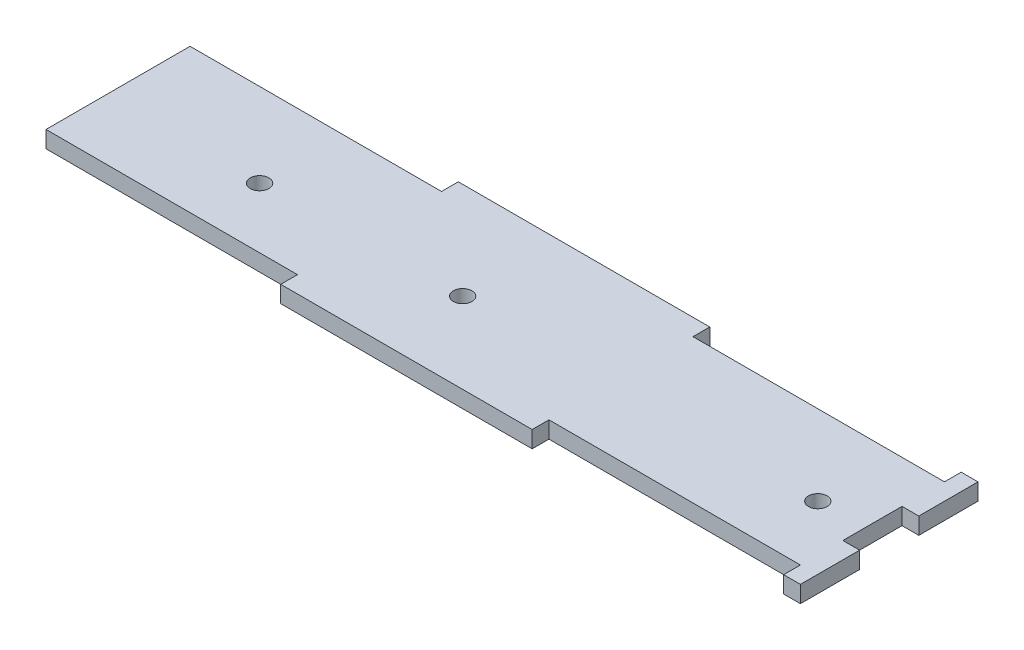
ISO-10303-21;
HEADER;
FILE_DESCRIPTION(('STEP AP214'),'2;1');
FILE_NAME('part.step','',(''),(''),'','','');
FILE_SCHEMA(('AUTOMOTIVE_DESIGN { 1 0 10303 214 1 1 1 1 }'));
ENDSEC;
DATA;
#1=APPLICATION_CONTEXT('core data for automotive mechanical design processes');
#2=APPLICATION_PROTOCOL_DEFINITION('international standard','automotive_design',2000,#1);
#3=PRODUCT_CONTEXT('',#1,'mechanical');
#4=PRODUCT('Part','Part','',(#3));
#5=PRODUCT_RELATED_PRODUCT_CATEGORY('part','',(#4));
#6=PRODUCT_DEFINITION_FORMATION('','',#4);
#7=PRODUCT_DEFINITION_CONTEXT('part definition',#1,'design');
#8=PRODUCT_DEFINITION('design','',#6,#7);
#9=PRODUCT_DEFINITION_SHAPE('','',#8);
#10=(LENGTH_UNIT() NAMED_UNIT(*) SI_UNIT(.MILLI.,.METRE.));
#11=(NAMED_UNIT(*) PLANE_ANGLE_UNIT() SI_UNIT($,.RADIAN.));
#12=(NAMED_UNIT(*) SI_UNIT($,.STERADIAN.) SOLID_ANGLE_UNIT());
#13=UNCERTAINTY_MEASURE_WITH_UNIT(LENGTH_MEASURE(1.E-05),#10,'distance_accuracy_value','');
#14=(GEOMETRIC_REPRESENTATION_CONTEXT(3) GLOBAL_UNCERTAINTY_ASSIGNED_CONTEXT((#13)) GLOBAL_UNIT_ASSIGNED_CONTEXT((#10,
#11,#12)) REPRESENTATION_CONTEXT('',''));
#15=CARTESIAN_POINT('',(0.,0.,0.));
#16=DIRECTION('',(0.,0.,1.));
#17=DIRECTION('',(1.,0.,0.));
#18=AXIS2_PLACEMENT_3D('',#15,#16,#17);
#19=CARTESIAN_POINT('',(-117.5,2.7,1.71046160917993E-13));
#20=DIRECTION('',(1.,0.,0.));
#21=DIRECTION('',(0.,0.,-1.));
#22=AXIS2_PLACEMENT_3D('',#19,#20,#21);
#23=PLANE('',#22);
#24=DIRECTION('',(0.,0.,1.));
#25=VECTOR('',#24,1.);
#26=CARTESIAN_POINT('',(-117.5,0.,1.71046160917993E-13));
#27=LINE('',#26,#25);
#28=CARTESIAN_POINT('',(-117.5,0.,-19.2));
#29=VERTEX_POINT('',#28);
#30=CARTESIAN_POINT('',(-117.5,0.,4.));
#31=VERTEX_POINT('',#30);
#32=EDGE_CURVE('E215',#29,#31,#27,.T.);
#33=ORIENTED_EDGE('',*,*,#32,.T.);
#34=DIRECTION('',(0.,-1.,0.));
#35=VECTOR('',#34,1.);
#36=CARTESIAN_POINT('',(-117.5,2.7,4.));
#37=LINE('',#36,#35);
#38=CARTESIAN_POINT('',(-117.5,2.7,4.));
#39=VERTEX_POINT('',#38);
#40=EDGE_CURVE('E11',#39,#31,#37,.T.);
#41=ORIENTED_EDGE('',*,*,#40,.F.);
#42=DIRECTION('',(0.,0.,1.));
#43=VECTOR('',#42,1.);
#44=CARTESIAN_POINT('',(-117.5,2.7,1.71046160917993E-13));
#45=LINE('',#44,#43);
#46=CARTESIAN_POINT('',(-117.5,2.7,-19.2));
#47=VERTEX_POINT('',#46);
#48=EDGE_CURVE('E627',#47,#39,#45,.T.);
#49=ORIENTED_EDGE('',*,*,#48,.F.);
#50=DIRECTION('',(0.,-1.,0.));
#51=VECTOR('',#50,1.);
#52=CARTESIAN_POINT('',(-117.5,2.7,-19.2));
#53=LINE('',#52,#51);
#54=EDGE_CURVE('E52',#47,#29,#53,.T.);
#55=ORIENTED_EDGE('',*,*,#54,.T.);
#56=EDGE_LOOP('',(#33,#41,#49,#55));
#57=FACE_BOUND('',#56,.T.);
#58=ADVANCED_FACE('F35',(#57),#23,.F.);
#59=CARTESIAN_POINT('',(0.,2.7,4.));
#60=DIRECTION('',(0.,0.,-1.));
#61=DIRECTION('',(-1.,0.,0.));
#62=AXIS2_PLACEMENT_3D('',#59,#60,#61);
#63=PLANE('',#62);
#64=DIRECTION('',(1.,0.,0.));
#65=VECTOR('',#64,1.);
#66=CARTESIAN_POINT('',(0.,0.,4.));
#67=LINE('',#66,#65);
#68=CARTESIAN_POINT('',(-77.,0.,4.));
#69=VERTEX_POINT('',#68);
#70=EDGE_CURVE('E217',#31,#69,#67,.T.);
#71=ORIENTED_EDGE('',*,*,#70,.T.);
#72=DIRECTION('',(0.,-1.,0.));
#73=VECTOR('',#72,1.);
#74=CARTESIAN_POINT('',(-77.,2.7,4.));
#75=LINE('',#74,#73);
#76=CARTESIAN_POINT('',(-77.,2.7,4.));
#77=VERTEX_POINT('',#76);
#78=EDGE_CURVE('E44',#77,#69,#75,.T.);
#79=ORIENTED_EDGE('',*,*,#78,.F.);
#80=DIRECTION('',(1.,0.,0.));
#81=VECTOR('',#80,1.);
#82=CARTESIAN_POINT('',(0.,2.7,4.));
#83=LINE('',#82,#81);
#84=EDGE_CURVE('E126',#39,#77,#83,.T.);
#85=ORIENTED_EDGE('',*,*,#84,.F.);
#86=ORIENTED_EDGE('',*,*,#40,.T.);
#87=EDGE_LOOP('',(#71,#79,#85,#86));
#88=FACE_BOUND('',#87,.T.);
#89=ADVANCED_FACE('F372',(#88),#63,.F.);
#90=CARTESIAN_POINT('',(-77.,2.7,0.));
#91=DIRECTION('',(1.,0.,0.));
#92=DIRECTION('',(0.,0.,-1.));
#93=AXIS2_PLACEMENT_3D('',#90,#91,#92);
#94=PLANE('',#93);
#95=DIRECTION('',(0.,0.,1.));
#96=VECTOR('',#95,1.);
#97=CARTESIAN_POINT('',(-77.,0.,0.));
#98=LINE('',#97,#96);
#99=CARTESIAN_POINT('',(-77.,0.,6.70000000000001));
#100=VERTEX_POINT('',#99);
#101=EDGE_CURVE('E219',#69,#100,#98,.T.);
#102=ORIENTED_EDGE('',*,*,#101,.T.);
#103=DIRECTION('',(0.,-1.,0.));
#104=VECTOR('',#103,1.);
#105=CARTESIAN_POINT('',(-77.,2.7,6.70000000000001));
#106=LINE('',#105,#104);
#107=CARTESIAN_POINT('',(-77.,2.7,6.70000000000001));
#108=VERTEX_POINT('',#107);
#109=EDGE_CURVE('E299',#108,#100,#106,.T.);
#110=ORIENTED_EDGE('',*,*,#109,.F.);
#111=DIRECTION('',(0.,0.,1.));
#112=VECTOR('',#111,1.);
#113=CARTESIAN_POINT('',(-77.,2.7,0.));
#114=LINE('',#113,#112);
#115=EDGE_CURVE('E306',#77,#108,#114,.T.);
#116=ORIENTED_EDGE('',*,*,#115,.F.);
#117=ORIENTED_EDGE('',*,*,#78,.T.);
#118=EDGE_LOOP('',(#102,#110,#116,#117));
#119=FACE_BOUND('',#118,.T.);
#120=ADVANCED_FACE('F304',(#119),#94,.F.);
#121=CARTESIAN_POINT('',(0.,2.7,6.7));
#122=DIRECTION('',(0.,0.,1.));
#123=DIRECTION('',(1.,0.,0.));
#124=AXIS2_PLACEMENT_3D('',#121,#122,#123);
#125=PLANE('',#124);
#126=DIRECTION('',(-1.,0.,0.));
#127=VECTOR('',#126,1.);
#128=CARTESIAN_POINT('',(0.,0.,6.7));
#129=LINE('',#128,#127);
#130=CARTESIAN_POINT('',(-36.5,0.,6.7));
#131=VERTEX_POINT('',#130);
#132=EDGE_CURVE('E222',#131,#100,#129,.T.);
#133=ORIENTED_EDGE('',*,*,#132,.F.);
#134=DIRECTION('',(0.,-1.,0.));
#135=VECTOR('',#134,1.);
#136=CARTESIAN_POINT('',(-36.5,2.7,6.7));
#137=LINE('',#136,#135);
#138=CARTESIAN_POINT('',(-36.5,2.7,6.7));
#139=VERTEX_POINT('',#138);
#140=EDGE_CURVE('E297',#139,#131,#137,.T.);
#141=ORIENTED_EDGE('',*,*,#140,.F.);
#142=DIRECTION('',(-1.,0.,0.));
#143=VECTOR('',#142,1.);
#144=CARTESIAN_POINT('',(0.,2.7,6.7));
#145=LINE('',#144,#143);
#146=EDGE_CURVE('E316',#139,#108,#145,.T.);
#147=ORIENTED_EDGE('',*,*,#146,.T.);
#148=ORIENTED_EDGE('',*,*,#109,.T.);
#149=EDGE_LOOP('',(#133,#141,#147,#148));
#150=FACE_BOUND('',#149,.T.);
#151=ADVANCED_FACE('F313',(#150),#125,.T.);
#152=CARTESIAN_POINT('',(-36.5,2.7,0.));
#153=DIRECTION('',(1.,0.,0.));
#154=DIRECTION('',(0.,0.,-1.));
#155=AXIS2_PLACEMENT_3D('',#152,#153,#154);
#156=PLANE('',#155);
#157=DIRECTION('',(0.,0.,1.));
#158=VECTOR('',#157,1.);
#159=CARTESIAN_POINT('',(-36.5,0.,0.));
#160=LINE('',#159,#158);
#161=CARTESIAN_POINT('',(-36.5,0.,4.));
#162=VERTEX_POINT('',#161);
#163=EDGE_CURVE('E225',#162,#131,#160,.T.);
#164=ORIENTED_EDGE('',*,*,#163,.F.);
#165=DIRECTION('',(0.,-1.,0.));
#166=VECTOR('',#165,1.);
#167=CARTESIAN_POINT('',(-36.5,2.7,4.));
#168=LINE('',#167,#166);
#169=CARTESIAN_POINT('',(-36.5,2.7,4.));
#170=VERTEX_POINT('',#169);
#171=EDGE_CURVE('E295',#170,#162,#168,.T.);
#172=ORIENTED_EDGE('',*,*,#171,.F.);
#173=DIRECTION('',(0.,0.,1.));
#174=VECTOR('',#173,1.);
#175=CARTESIAN_POINT('',(-36.5,2.7,0.));
#176=LINE('',#175,#174);
#177=EDGE_CURVE('E319',#170,#139,#176,.T.);
#178=ORIENTED_EDGE('',*,*,#177,.T.);
#179=ORIENTED_EDGE('',*,*,#140,.T.);
#180=EDGE_LOOP('',(#164,#172,#178,#179));
#181=FACE_BOUND('',#180,.T.);
#182=ADVANCED_FACE('F551',(#181),#156,.T.);
#183=CARTESIAN_POINT('',(0.,2.7,4.));
#184=DIRECTION('',(0.,0.,-1.));
#185=DIRECTION('',(-1.,0.,0.));
#186=AXIS2_PLACEMENT_3D('',#183,#184,#185);
#187=PLANE('',#186);
#188=DIRECTION('',(1.,0.,0.));
#189=VECTOR('',#188,1.);
#190=CARTESIAN_POINT('',(0.,0.,4.));
#191=LINE('',#190,#189);
#192=CARTESIAN_POINT('',(4.,0.,4.));
#193=VERTEX_POINT('',#192);
#194=EDGE_CURVE('E228',#162,#193,#191,.T.);
#195=ORIENTED_EDGE('',*,*,#194,.T.);
#196=DIRECTION('',(0.,-1.,0.));
#197=VECTOR('',#196,1.);
#198=CARTESIAN_POINT('',(4.,2.7,4.));
#199=LINE('',#198,#197);
#200=CARTESIAN_POINT('',(4.,2.7,4.));
#201=VERTEX_POINT('',#200);
#202=EDGE_CURVE('E292',#201,#193,#199,.T.);
#203=ORIENTED_EDGE('',*,*,#202,.F.);
#204=DIRECTION('',(1.,0.,0.));
#205=VECTOR('',#204,1.);
#206=CARTESIAN_POINT('',(0.,2.7,4.));
#207=LINE('',#206,#205);
#208=EDGE_CURVE('E321',#170,#201,#207,.T.);
#209=ORIENTED_EDGE('',*,*,#208,.F.);
#210=ORIENTED_EDGE('',*,*,#171,.T.);
#211=EDGE_LOOP('',(#195,#203,#209,#210));
#212=FACE_BOUND('',#211,.T.);
#213=ADVANCED_FACE('F542',(#212),#187,.F.);
#214=CARTESIAN_POINT('',(4.,2.7,0.));
#215=DIRECTION('',(1.,0.,0.));
#216=DIRECTION('',(0.,0.,-1.));
#217=AXIS2_PLACEMENT_3D('',#214,#215,#216);
#218=PLANE('',#217);
#219=DIRECTION('',(0.,0.,1.));
#220=VECTOR('',#219,1.);
#221=CARTESIAN_POINT('',(4.,0.,0.));
#222=LINE('',#221,#220);
#223=CARTESIAN_POINT('',(4.,0.,6.7));
#224=VERTEX_POINT('',#223);
#225=EDGE_CURVE('E230',#193,#224,#222,.T.);
#226=ORIENTED_EDGE('',*,*,#225,.T.);
#227=DIRECTION('',(0.,-1.,0.));
#228=VECTOR('',#227,1.);
#229=CARTESIAN_POINT('',(4.,2.7,6.7));
#230=LINE('',#229,#228);
#231=CARTESIAN_POINT('',(4.,2.7,6.7));
#232=VERTEX_POINT('',#231);
#233=EDGE_CURVE('E290',#232,#224,#230,.T.);
#234=ORIENTED_EDGE('',*,*,#233,.F.);
#235=DIRECTION('',(0.,0.,1.));
#236=VECTOR('',#235,1.);
#237=CARTESIAN_POINT('',(4.,2.7,0.));
#238=LINE('',#237,#236);
#239=EDGE_CURVE('E327',#201,#232,#238,.T.);
#240=ORIENTED_EDGE('',*,*,#239,.F.);
#241=ORIENTED_EDGE('',*,*,#202,.T.);
#242=EDGE_LOOP('',(#226,#234,#240,#241));
#243=FACE_BOUND('',#242,.T.);
#244=ADVANCED_FACE('F533',(#243),#218,.F.);
#245=CARTESIAN_POINT('',(0.,2.7,6.7));
#246=DIRECTION('',(0.,0.,1.));
#247=DIRECTION('',(1.,0.,0.));
#248=AXIS2_PLACEMENT_3D('',#245,#246,#247);
#249=PLANE('',#248);
#250=DIRECTION('',(-1.,0.,0.));
#251=VECTOR('',#250,1.);
#252=CARTESIAN_POINT('',(0.,0.,6.7));
#253=LINE('',#252,#251);
#254=CARTESIAN_POINT('',(6.7,0.,6.7));
#255=VERTEX_POINT('',#254);
#256=EDGE_CURVE('E233',#255,#224,#253,.T.);
#257=ORIENTED_EDGE('',*,*,#256,.F.);
#258=DIRECTION('',(0.,-1.,0.));
#259=VECTOR('',#258,1.);
#260=CARTESIAN_POINT('',(6.7,2.7,6.7));
#261=LINE('',#260,#259);
#262=CARTESIAN_POINT('',(6.7,2.7,6.7));
#263=VERTEX_POINT('',#262);
#264=EDGE_CURVE('E288',#263,#255,#261,.T.);
#265=ORIENTED_EDGE('',*,*,#264,.F.);
#266=DIRECTION('',(-1.,0.,0.));
#267=VECTOR('',#266,1.);
#268=CARTESIAN_POINT('',(0.,2.7,6.7));
#269=LINE('',#268,#267);
#270=EDGE_CURVE('E329',#263,#232,#269,.T.);
#271=ORIENTED_EDGE('',*,*,#270,.T.);
#272=ORIENTED_EDGE('',*,*,#233,.T.);
#273=EDGE_LOOP('',(#257,#265,#271,#272));
#274=FACE_BOUND('',#273,.T.);
#275=ADVANCED_FACE('F524',(#274),#249,.T.);
#276=CARTESIAN_POINT('',(6.7,2.7,0.));
#277=DIRECTION('',(-1.,0.,0.));
#278=DIRECTION('',(0.,0.,1.));
#279=AXIS2_PLACEMENT_3D('',#276,#277,#278);
#280=PLANE('',#279);
#281=DIRECTION('',(0.,0.,-1.));
#282=VECTOR('',#281,1.);
#283=CARTESIAN_POINT('',(6.7,0.,0.));
#284=LINE('',#283,#282);
#285=CARTESIAN_POINT('',(6.7,0.,-2.83333333333334));
#286=VERTEX_POINT('',#285);
#287=EDGE_CURVE('E236',#255,#286,#284,.T.);
#288=ORIENTED_EDGE('',*,*,#287,.T.);
#289=DIRECTION('',(0.,-1.,0.));
#290=VECTOR('',#289,1.);
#291=CARTESIAN_POINT('',(6.7,2.7,-2.83333333333334));
#292=LINE('',#291,#290);
#293=CARTESIAN_POINT('',(6.7,2.7,-2.83333333333334));
#294=VERTEX_POINT('',#293);
#295=EDGE_CURVE('E285',#294,#286,#292,.T.);
#296=ORIENTED_EDGE('',*,*,#295,.F.);
#297=DIRECTION('',(0.,0.,-1.));
#298=VECTOR('',#297,1.);
#299=CARTESIAN_POINT('',(6.7,2.7,0.));
#300=LINE('',#299,#298);
#301=EDGE_CURVE('E332',#263,#294,#300,.T.);
#302=ORIENTED_EDGE('',*,*,#301,.F.);
#303=ORIENTED_EDGE('',*,*,#264,.T.);
#304=EDGE_LOOP('',(#288,#296,#302,#303));
#305=FACE_BOUND('',#304,.T.);
#306=ADVANCED_FACE('F515',(#305),#280,.F.);
#307=CARTESIAN_POINT('',(0.,2.7,-2.83333333333334));
#308=DIRECTION('',(0.,0.,1.));
#309=DIRECTION('',(1.,0.,0.));
#310=AXIS2_PLACEMENT_3D('',#307,#308,#309);
#311=PLANE('',#310);
#312=DIRECTION('',(-1.,0.,0.));
#313=VECTOR('',#312,1.);
#314=CARTESIAN_POINT('',(0.,0.,-2.83333333333334));
#315=LINE('',#314,#313);
#316=CARTESIAN_POINT('',(4.,0.,-2.83333333333334));
#317=VERTEX_POINT('',#316);
#318=EDGE_CURVE('E238',#286,#317,#315,.T.);
#319=ORIENTED_EDGE('',*,*,#318,.T.);
#320=DIRECTION('',(0.,-1.,0.));
#321=VECTOR('',#320,1.);
#322=CARTESIAN_POINT('',(4.,2.7,-2.83333333333334));
#323=LINE('',#322,#321);
#324=CARTESIAN_POINT('',(4.,2.7,-2.83333333333334));
#325=VERTEX_POINT('',#324);
#326=EDGE_CURVE('E282',#325,#317,#323,.T.);
#327=ORIENTED_EDGE('',*,*,#326,.F.);
#328=DIRECTION('',(-1.,0.,0.));
#329=VECTOR('',#328,1.);
#330=CARTESIAN_POINT('',(0.,2.7,-2.83333333333334));
#331=LINE('',#330,#329);
#332=EDGE_CURVE('E334',#294,#325,#331,.T.);
#333=ORIENTED_EDGE('',*,*,#332,.F.);
#334=ORIENTED_EDGE('',*,*,#295,.T.);
#335=EDGE_LOOP('',(#319,#327,#333,#334));
#336=FACE_BOUND('',#335,.T.);
#337=ADVANCED_FACE('F506',(#336),#311,.F.);
#338=CARTESIAN_POINT('',(4.,2.7,0.));
#339=DIRECTION('',(-1.,0.,0.));
#340=DIRECTION('',(0.,0.,1.));
#341=AXIS2_PLACEMENT_3D('',#338,#339,#340);
#342=PLANE('',#341);
#343=DIRECTION('',(0.,0.,-1.));
#344=VECTOR('',#343,1.);
#345=CARTESIAN_POINT('',(4.,0.,0.));
#346=LINE('',#345,#344);
#347=CARTESIAN_POINT('',(4.,0.,-12.3666666666667));
#348=VERTEX_POINT('',#347);
#349=EDGE_CURVE('E240',#317,#348,#346,.T.);
#350=ORIENTED_EDGE('',*,*,#349,.T.);
#351=DIRECTION('',(0.,-1.,0.));
#352=VECTOR('',#351,1.);
#353=CARTESIAN_POINT('',(4.,2.7,-12.3666666666667));
#354=LINE('',#353,#352);
#355=CARTESIAN_POINT('',(4.,2.7,-12.3666666666667));
#356=VERTEX_POINT('',#355);
#357=EDGE_CURVE('E280',#356,#348,#354,.T.);
#358=ORIENTED_EDGE('',*,*,#357,.F.);
#359=DIRECTION('',(0.,0.,-1.));
#360=VECTOR('',#359,1.);
#361=CARTESIAN_POINT('',(4.,2.7,0.));
#362=LINE('',#361,#360);
#363=EDGE_CURVE('E336',#325,#356,#362,.T.);
#364=ORIENTED_EDGE('',*,*,#363,.F.);
#365=ORIENTED_EDGE('',*,*,#326,.T.);
#366=EDGE_LOOP('',(#350,#358,#364,#365));
#367=FACE_BOUND('',#366,.T.);
#368=ADVANCED_FACE('F497',(#367),#342,.F.);
#369=CARTESIAN_POINT('',(0.,2.7,-12.3666666666667));
#370=DIRECTION('',(0.,0.,1.));
#371=DIRECTION('',(1.,0.,0.));
#372=AXIS2_PLACEMENT_3D('',#369,#370,#371);
#373=PLANE('',#372);
#374=DIRECTION('',(-1.,0.,0.));
#375=VECTOR('',#374,1.);
#376=CARTESIAN_POINT('',(0.,0.,-12.3666666666667));
#377=LINE('',#376,#375);
#378=CARTESIAN_POINT('',(6.7,0.,-12.3666666666667));
#379=VERTEX_POINT('',#378);
#380=EDGE_CURVE('E243',#379,#348,#377,.T.);
#381=ORIENTED_EDGE('',*,*,#380,.F.);
#382=DIRECTION('',(0.,-1.,0.));
#383=VECTOR('',#382,1.);
#384=CARTESIAN_POINT('',(6.7,2.7,-12.3666666666667));
#385=LINE('',#384,#383);
#386=CARTESIAN_POINT('',(6.7,2.7,-12.3666666666667));
#387=VERTEX_POINT('',#386);
#388=EDGE_CURVE('E278',#387,#379,#385,.T.);
#389=ORIENTED_EDGE('',*,*,#388,.F.);
#390=DIRECTION('',(-1.,0.,0.));
#391=VECTOR('',#390,1.);
#392=CARTESIAN_POINT('',(0.,2.7,-12.3666666666667));
#393=LINE('',#392,#391);
#394=EDGE_CURVE('E338',#387,#356,#393,.T.);
#395=ORIENTED_EDGE('',*,*,#394,.T.);
#396=ORIENTED_EDGE('',*,*,#357,.T.);
#397=EDGE_LOOP('',(#381,#389,#395,#396));
#398=FACE_BOUND('',#397,.T.);
#399=ADVANCED_FACE('F488',(#398),#373,.T.);
#400=CARTESIAN_POINT('',(6.7,2.7,0.));
#401=DIRECTION('',(-1.,0.,0.));
#402=DIRECTION('',(0.,0.,1.));
#403=AXIS2_PLACEMENT_3D('',#400,#401,#402);
#404=PLANE('',#403);
#405=DIRECTION('',(0.,0.,-1.));
#406=VECTOR('',#405,1.);
#407=CARTESIAN_POINT('',(6.7,0.,0.));
#408=LINE('',#407,#406);
#409=CARTESIAN_POINT('',(6.7,0.,-21.9));
#410=VERTEX_POINT('',#409);
#411=EDGE_CURVE('E246',#379,#410,#408,.T.);
#412=ORIENTED_EDGE('',*,*,#411,.T.);
#413=DIRECTION('',(0.,-1.,0.));
#414=VECTOR('',#413,1.);
#415=CARTESIAN_POINT('',(6.7,2.7,-21.9));
#416=LINE('',#415,#414);
#417=CARTESIAN_POINT('',(6.7,2.7,-21.9));
#418=VERTEX_POINT('',#417);
#419=EDGE_CURVE('E275',#418,#410,#416,.T.);
#420=ORIENTED_EDGE('',*,*,#419,.F.);
#421=DIRECTION('',(0.,0.,-1.));
#422=VECTOR('',#421,1.);
#423=CARTESIAN_POINT('',(6.7,2.7,0.));
#424=LINE('',#423,#422);
#425=EDGE_CURVE('E341',#387,#418,#424,.T.);
#426=ORIENTED_EDGE('',*,*,#425,.F.);
#427=ORIENTED_EDGE('',*,*,#388,.T.);
#428=EDGE_LOOP('',(#412,#420,#426,#427));
#429=FACE_BOUND('',#428,.T.);
#430=ADVANCED_FACE('F479',(#429),#404,.F.);
#431=CARTESIAN_POINT('',(0.,2.7,-21.9));
#432=DIRECTION('',(0.,0.,1.));
#433=DIRECTION('',(1.,0.,0.));
#434=AXIS2_PLACEMENT_3D('',#431,#432,#433);
#435=PLANE('',#434);
#436=DIRECTION('',(-1.,0.,0.));
#437=VECTOR('',#436,1.);
#438=CARTESIAN_POINT('',(0.,0.,-21.9));
#439=LINE('',#438,#437);
#440=CARTESIAN_POINT('',(4.,0.,-21.9));
#441=VERTEX_POINT('',#440);
#442=EDGE_CURVE('E248',#410,#441,#439,.T.);
#443=ORIENTED_EDGE('',*,*,#442,.T.);
#444=DIRECTION('',(0.,-1.,0.));
#445=VECTOR('',#444,1.);
#446=CARTESIAN_POINT('',(4.,2.7,-21.9));
#447=LINE('',#446,#445);
#448=CARTESIAN_POINT('',(4.,2.7,-21.9));
#449=VERTEX_POINT('',#448);
#450=EDGE_CURVE('E273',#449,#441,#447,.T.);
#451=ORIENTED_EDGE('',*,*,#450,.F.);
#452=DIRECTION('',(-1.,0.,0.));
#453=VECTOR('',#452,1.);
#454=CARTESIAN_POINT('',(0.,2.7,-21.9));
#455=LINE('',#454,#453);
#456=EDGE_CURVE('E343',#418,#449,#455,.T.);
#457=ORIENTED_EDGE('',*,*,#456,.F.);
#458=ORIENTED_EDGE('',*,*,#419,.T.);
#459=EDGE_LOOP('',(#443,#451,#457,#458));
#460=FACE_BOUND('',#459,.T.);
#461=ADVANCED_FACE('F471',(#460),#435,.F.);
#462=CARTESIAN_POINT('',(4.,2.7,0.));
#463=DIRECTION('',(-1.,0.,0.));
#464=DIRECTION('',(0.,0.,1.));
#465=AXIS2_PLACEMENT_3D('',#462,#463,#464);
#466=PLANE('',#465);
#467=DIRECTION('',(0.,0.,-1.));
#468=VECTOR('',#467,1.);
#469=CARTESIAN_POINT('',(4.,0.,0.));
#470=LINE('',#469,#468);
#471=CARTESIAN_POINT('',(4.,0.,-19.2));
#472=VERTEX_POINT('',#471);
#473=EDGE_CURVE('E251',#472,#441,#470,.T.);
#474=ORIENTED_EDGE('',*,*,#473,.F.);
#475=DIRECTION('',(0.,-1.,0.));
#476=VECTOR('',#475,1.);
#477=CARTESIAN_POINT('',(4.,2.7,-19.2));
#478=LINE('',#477,#476);
#479=CARTESIAN_POINT('',(4.,2.7,-19.2));
#480=VERTEX_POINT('',#479);
#481=EDGE_CURVE('E271',#480,#472,#478,.T.);
#482=ORIENTED_EDGE('',*,*,#481,.F.);
#483=DIRECTION('',(0.,0.,-1.));
#484=VECTOR('',#483,1.);
#485=CARTESIAN_POINT('',(4.,2.7,0.));
#486=LINE('',#485,#484);
#487=EDGE_CURVE('E345',#480,#449,#486,.T.);
#488=ORIENTED_EDGE('',*,*,#487,.T.);
#489=ORIENTED_EDGE('',*,*,#450,.T.);
#490=EDGE_LOOP('',(#474,#482,#488,#489));
#491=FACE_BOUND('',#490,.T.);
#492=ADVANCED_FACE('F358',(#491),#466,.T.);
#493=CARTESIAN_POINT('',(0.,2.7,-19.2));
#494=DIRECTION('',(0.,0.,-1.));
#495=DIRECTION('',(-1.,0.,0.));
#496=AXIS2_PLACEMENT_3D('',#493,#494,#495);
#497=PLANE('',#496);
#498=DIRECTION('',(1.,0.,0.));
#499=VECTOR('',#498,1.);
#500=CARTESIAN_POINT('',(0.,0.,-19.2));
#501=LINE('',#500,#499);
#502=CARTESIAN_POINT('',(-36.5,0.,-19.2));
#503=VERTEX_POINT('',#502);
#504=EDGE_CURVE('E254',#503,#472,#501,.T.);
#505=ORIENTED_EDGE('',*,*,#504,.F.);
#506=DIRECTION('',(0.,-1.,0.));
#507=VECTOR('',#506,1.);
#508=CARTESIAN_POINT('',(-36.5,2.7,-19.2));
#509=LINE('',#508,#507);
#510=CARTESIAN_POINT('',(-36.5,2.7,-19.2));
#511=VERTEX_POINT('',#510);
#512=EDGE_CURVE('E269',#511,#503,#509,.T.);
#513=ORIENTED_EDGE('',*,*,#512,.F.);
#514=DIRECTION('',(1.,0.,0.));
#515=VECTOR('',#514,1.);
#516=CARTESIAN_POINT('',(0.,2.7,-19.2));
#517=LINE('',#516,#515);
#518=EDGE_CURVE('E348',#511,#480,#517,.T.);
#519=ORIENTED_EDGE('',*,*,#518,.T.);
#520=ORIENTED_EDGE('',*,*,#481,.T.);
#521=EDGE_LOOP('',(#505,#513,#519,#520));
#522=FACE_BOUND('',#521,.T.);
#523=ADVANCED_FACE('F352',(#522),#497,.T.);
#524=CARTESIAN_POINT('',(-36.5,2.7,0.));
#525=DIRECTION('',(-1.,0.,0.));
#526=DIRECTION('',(0.,0.,1.));
#527=AXIS2_PLACEMENT_3D('',#524,#525,#526);
#528=PLANE('',#527);
#529=DIRECTION('',(0.,0.,-1.));
#530=VECTOR('',#529,1.);
#531=CARTESIAN_POINT('',(-36.5,0.,0.));
#532=LINE('',#531,#530);
#533=CARTESIAN_POINT('',(-36.5,0.,-21.9));
#534=VERTEX_POINT('',#533);
#535=EDGE_CURVE('E257',#503,#534,#532,.T.);
#536=ORIENTED_EDGE('',*,*,#535,.T.);
#537=DIRECTION('',(0.,-1.,0.));
#538=VECTOR('',#537,1.);
#539=CARTESIAN_POINT('',(-36.5,2.7,-21.9));
#540=LINE('',#539,#538);
#541=CARTESIAN_POINT('',(-36.5,2.7,-21.9));
#542=VERTEX_POINT('',#541);
#543=EDGE_CURVE('E198',#542,#534,#540,.T.);
#544=ORIENTED_EDGE('',*,*,#543,.F.);
#545=DIRECTION('',(0.,0.,-1.));
#546=VECTOR('',#545,1.);
#547=CARTESIAN_POINT('',(-36.5,2.7,0.));
#548=LINE('',#547,#546);
#549=EDGE_CURVE('E186',#511,#542,#548,.T.);
#550=ORIENTED_EDGE('',*,*,#549,.F.);
#551=ORIENTED_EDGE('',*,*,#512,.T.);
#552=EDGE_LOOP('',(#536,#544,#550,#551));
#553=FACE_BOUND('',#552,.T.);
#554=ADVANCED_FACE('F362',(#553),#528,.F.);
#555=CARTESIAN_POINT('',(0.,2.7,-21.9));
#556=DIRECTION('',(0.,0.,1.));
#557=DIRECTION('',(1.,0.,0.));
#558=AXIS2_PLACEMENT_3D('',#555,#556,#557);
#559=PLANE('',#558);
#560=DIRECTION('',(-1.,0.,0.));
#561=VECTOR('',#560,1.);
#562=CARTESIAN_POINT('',(0.,0.,-21.9));
#563=LINE('',#562,#561);
#564=CARTESIAN_POINT('',(-77.,0.,-21.9));
#565=VERTEX_POINT('',#564);
#566=EDGE_CURVE('E195',#534,#565,#563,.T.);
#567=ORIENTED_EDGE('',*,*,#566,.T.);
#568=DIRECTION('',(0.,-1.,0.));
#569=VECTOR('',#568,1.);
#570=CARTESIAN_POINT('',(-77.,2.7,-21.9));
#571=LINE('',#570,#569);
#572=CARTESIAN_POINT('',(-77.,2.7,-21.9));
#573=VERTEX_POINT('',#572);
#574=EDGE_CURVE('E192',#573,#565,#571,.T.);
#575=ORIENTED_EDGE('',*,*,#574,.F.);
#576=DIRECTION('',(-1.,0.,0.));
#577=VECTOR('',#576,1.);
#578=CARTESIAN_POINT('',(0.,2.7,-21.9));
#579=LINE('',#578,#577);
#580=EDGE_CURVE('E178',#542,#573,#579,.T.);
#581=ORIENTED_EDGE('',*,*,#580,.F.);
#582=ORIENTED_EDGE('',*,*,#543,.T.);
#583=EDGE_LOOP('',(#567,#575,#581,#582));
#584=FACE_BOUND('',#583,.T.);
#585=ADVANCED_FACE('F193',(#584),#559,.F.);
#586=CARTESIAN_POINT('',(-77.,2.7,0.));
#587=DIRECTION('',(-1.,0.,0.));
#588=DIRECTION('',(0.,0.,1.));
#589=AXIS2_PLACEMENT_3D('',#586,#587,#588);
#590=PLANE('',#589);
#591=DIRECTION('',(0.,0.,-1.));
#592=VECTOR('',#591,1.);
#593=CARTESIAN_POINT('',(-77.,0.,0.));
#594=LINE('',#593,#592);
#595=CARTESIAN_POINT('',(-77.,0.,-19.2));
#596=VERTEX_POINT('',#595);
#597=EDGE_CURVE('E260',#596,#565,#594,.T.);
#598=ORIENTED_EDGE('',*,*,#597,.F.);
#599=DIRECTION('',(0.,-1.,0.));
#600=VECTOR('',#599,1.);
#601=CARTESIAN_POINT('',(-77.,2.7,-19.2));
#602=LINE('',#601,#600);
#603=CARTESIAN_POINT('',(-77.,2.7,-19.2));
#604=VERTEX_POINT('',#603);
#605=EDGE_CURVE('E114',#604,#596,#602,.T.);
#606=ORIENTED_EDGE('',*,*,#605,.F.);
#607=DIRECTION('',(0.,0.,-1.));
#608=VECTOR('',#607,1.);
#609=CARTESIAN_POINT('',(-77.,2.7,0.));
#610=LINE('',#609,#608);
#611=EDGE_CURVE('E183',#604,#573,#610,.T.);
#612=ORIENTED_EDGE('',*,*,#611,.T.);
#613=ORIENTED_EDGE('',*,*,#574,.T.);
#614=EDGE_LOOP('',(#598,#606,#612,#613));
#615=FACE_BOUND('',#614,.T.);
#616=ADVANCED_FACE('F200',(#615),#590,.T.);
#617=CARTESIAN_POINT('',(-3.5,2.7,-6.3));
#618=DIRECTION('',(0.,-1.,0.));
#619=DIRECTION('',(0.,0.,-1.));
#620=AXIS2_PLACEMENT_3D('',#617,#618,#619);
#621=CYLINDRICAL_SURFACE('',#620,1.5);
#622=CARTESIAN_POINT('',(-3.5,2.7,-6.3));
#623=DIRECTION('',(0.,1.,0.));
#624=DIRECTION('',(0.,0.,1.));
#625=AXIS2_PLACEMENT_3D('',#622,#623,#624);
#626=CIRCLE('',#625,1.5);
#627=CARTESIAN_POINT('',(-3.5,2.7,-4.8));
#628=VERTEX_POINT('',#627);
#629=EDGE_CURVE('E628',#628,#628,#626,.T.);
#630=ORIENTED_EDGE('',*,*,#629,.T.);
#631=EDGE_LOOP('',(#630));
#632=FACE_BOUND('',#631,.T.);
#633=CARTESIAN_POINT('',(-3.5,0.,-6.3));
#634=DIRECTION('',(0.,1.,0.));
#635=DIRECTION('',(0.,0.,1.));
#636=AXIS2_PLACEMENT_3D('',#633,#634,#635);
#637=CIRCLE('',#636,1.5);
#638=CARTESIAN_POINT('',(-3.5,0.,-4.8));
#639=VERTEX_POINT('',#638);
#640=EDGE_CURVE('E212',#639,#639,#637,.T.);
#641=ORIENTED_EDGE('',*,*,#640,.F.);
#642=EDGE_LOOP('',(#641));
#643=FACE_BOUND('',#642,.T.);
#644=ADVANCED_FACE('F380',(#632,#643),#621,.F.);
#645=CARTESIAN_POINT('',(-60.7,2.7,-6.29999999999999));
#646=DIRECTION('',(0.,-1.,0.));
#647=DIRECTION('',(0.,0.,-1.));
#648=AXIS2_PLACEMENT_3D('',#645,#646,#647);
#649=CYLINDRICAL_SURFACE('',#648,1.5);
#650=CARTESIAN_POINT('',(-60.7,2.7,-6.29999999999999));
#651=DIRECTION('',(0.,1.,0.));
#652=DIRECTION('',(0.,0.,1.));
#653=AXIS2_PLACEMENT_3D('',#650,#651,#652);
#654=CIRCLE('',#653,1.5);
#655=CARTESIAN_POINT('',(-60.7,2.7,-4.8));
#656=VERTEX_POINT('',#655);
#657=EDGE_CURVE('E394',#656,#656,#654,.T.);
#658=ORIENTED_EDGE('',*,*,#657,.T.);
#659=EDGE_LOOP('',(#658));
#660=FACE_BOUND('',#659,.T.);
#661=CARTESIAN_POINT('',(-60.7,0.,-6.29999999999999));
#662=DIRECTION('',(0.,1.,0.));
#663=DIRECTION('',(0.,0.,1.));
#664=AXIS2_PLACEMENT_3D('',#661,#662,#663);
#665=CIRCLE('',#664,1.5);
#666=CARTESIAN_POINT('',(-60.7,0.,-4.8));
#667=VERTEX_POINT('',#666);
#668=EDGE_CURVE('E209',#667,#667,#665,.T.);
#669=ORIENTED_EDGE('',*,*,#668,.F.);
#670=EDGE_LOOP('',(#669));
#671=FACE_BOUND('',#670,.T.);
#672=ADVANCED_FACE('F382',(#660,#671),#649,.F.);
#673=CARTESIAN_POINT('',(-92.8,2.7,-5.69999999999999));
#674=DIRECTION('',(0.,-1.,0.));
#675=DIRECTION('',(0.,0.,-1.));
#676=AXIS2_PLACEMENT_3D('',#673,#674,#675);
#677=CYLINDRICAL_SURFACE('',#676,1.5);
#678=CARTESIAN_POINT('',(-92.8,2.7,-5.69999999999999));
#679=DIRECTION('',(0.,1.,0.));
#680=DIRECTION('',(0.,0.,1.));
#681=AXIS2_PLACEMENT_3D('',#678,#679,#680);
#682=CIRCLE('',#681,1.5);
#683=CARTESIAN_POINT('',(-92.8,2.7,-4.19999999999999));
#684=VERTEX_POINT('',#683);
#685=EDGE_CURVE('E265',#684,#684,#682,.T.);
#686=ORIENTED_EDGE('',*,*,#685,.T.);
#687=EDGE_LOOP('',(#686));
#688=FACE_BOUND('',#687,.T.);
#689=CARTESIAN_POINT('',(-92.8,0.,-5.69999999999999));
#690=DIRECTION('',(0.,1.,0.));
#691=DIRECTION('',(0.,0.,1.));
#692=AXIS2_PLACEMENT_3D('',#689,#690,#691);
#693=CIRCLE('',#692,1.5);
#694=CARTESIAN_POINT('',(-92.8,0.,-4.19999999999999));
#695=VERTEX_POINT('',#694);
#696=EDGE_CURVE('E206',#695,#695,#693,.T.);
#697=ORIENTED_EDGE('',*,*,#696,.F.);
#698=EDGE_LOOP('',(#697));
#699=FACE_BOUND('',#698,.T.);
#700=ADVANCED_FACE('F37',(#688,#699),#677,.F.);
#701=CARTESIAN_POINT('',(0.,2.7,-19.2));
#702=DIRECTION('',(0.,0.,-1.));
#703=DIRECTION('',(-1.,0.,0.));
#704=AXIS2_PLACEMENT_3D('',#701,#702,#703);
#705=PLANE('',#704);
#706=DIRECTION('',(1.,0.,0.));
#707=VECTOR('',#706,1.);
#708=CARTESIAN_POINT('',(0.,0.,-19.2));
#709=LINE('',#708,#707);
#710=EDGE_CURVE('E262',#29,#596,#709,.T.);
#711=ORIENTED_EDGE('',*,*,#710,.F.);
#712=ORIENTED_EDGE('',*,*,#54,.F.);
#713=DIRECTION('',(1.,0.,0.));
#714=VECTOR('',#713,1.);
#715=CARTESIAN_POINT('',(0.,2.7,-19.2));
#716=LINE('',#715,#714);
#717=EDGE_CURVE('E201',#47,#604,#716,.T.);
#718=ORIENTED_EDGE('',*,*,#717,.T.);
#719=ORIENTED_EDGE('',*,*,#605,.T.);
#720=EDGE_LOOP('',(#711,#712,#718,#719));
#721=FACE_BOUND('',#720,.T.);
#722=ADVANCED_FACE('F389',(#721),#705,.T.);
#723=CARTESIAN_POINT('',(0.,2.7,0.));
#724=DIRECTION('',(0.,1.,0.));
#725=DIRECTION('',(0.,0.,1.));
#726=AXIS2_PLACEMENT_3D('',#723,#724,#725);
#727=PLANE('',#726);
#728=ORIENTED_EDGE('',*,*,#685,.F.);
#729=EDGE_LOOP('',(#728));
#730=FACE_BOUND('',#729,.T.);
#731=ORIENTED_EDGE('',*,*,#657,.F.);
#732=EDGE_LOOP('',(#731));
#733=FACE_BOUND('',#732,.T.);
#734=ORIENTED_EDGE('',*,*,#629,.F.);
#735=EDGE_LOOP('',(#734));
#736=FACE_BOUND('',#735,.T.);
#737=ORIENTED_EDGE('',*,*,#48,.T.);
#738=ORIENTED_EDGE('',*,*,#84,.T.);
#739=ORIENTED_EDGE('',*,*,#115,.T.);
#740=ORIENTED_EDGE('',*,*,#146,.F.);
#741=ORIENTED_EDGE('',*,*,#177,.F.);
#742=ORIENTED_EDGE('',*,*,#208,.T.);
#743=ORIENTED_EDGE('',*,*,#239,.T.);
#744=ORIENTED_EDGE('',*,*,#270,.F.);
#745=ORIENTED_EDGE('',*,*,#301,.T.);
#746=ORIENTED_EDGE('',*,*,#332,.T.);
#747=ORIENTED_EDGE('',*,*,#363,.T.);
#748=ORIENTED_EDGE('',*,*,#394,.F.);
#749=ORIENTED_EDGE('',*,*,#425,.T.);
#750=ORIENTED_EDGE('',*,*,#456,.T.);
#751=ORIENTED_EDGE('',*,*,#487,.F.);
#752=ORIENTED_EDGE('',*,*,#518,.F.);
#753=ORIENTED_EDGE('',*,*,#549,.T.);
#754=ORIENTED_EDGE('',*,*,#580,.T.);
#755=ORIENTED_EDGE('',*,*,#611,.F.);
#756=ORIENTED_EDGE('',*,*,#717,.F.);
#757=EDGE_LOOP('',(#737,#738,#739,#740,#741,#742,#743,#744,#745,#746,#747,#748,#749,#750,#751,
#752,#753,#754,#755,#756));
#758=FACE_BOUND('',#757,.T.);
#759=ADVANCED_FACE('F180',(#730,#733,#736,#758),#727,.T.);
#760=CARTESIAN_POINT('',(0.,0.,0.));
#761=DIRECTION('',(0.,1.,0.));
#762=DIRECTION('',(0.,0.,1.));
#763=AXIS2_PLACEMENT_3D('',#760,#761,#762);
#764=PLANE('',#763);
#765=ORIENTED_EDGE('',*,*,#696,.T.);
#766=EDGE_LOOP('',(#765));
#767=FACE_BOUND('',#766,.T.);
#768=ORIENTED_EDGE('',*,*,#668,.T.);
#769=EDGE_LOOP('',(#768));
#770=FACE_BOUND('',#769,.T.);
#771=ORIENTED_EDGE('',*,*,#640,.T.);
#772=EDGE_LOOP('',(#771));
#773=FACE_BOUND('',#772,.T.);
#774=ORIENTED_EDGE('',*,*,#32,.F.);
#775=ORIENTED_EDGE('',*,*,#710,.T.);
#776=ORIENTED_EDGE('',*,*,#597,.T.);
#777=ORIENTED_EDGE('',*,*,#566,.F.);
#778=ORIENTED_EDGE('',*,*,#535,.F.);
#779=ORIENTED_EDGE('',*,*,#504,.T.);
#780=ORIENTED_EDGE('',*,*,#473,.T.);
#781=ORIENTED_EDGE('',*,*,#442,.F.);
#782=ORIENTED_EDGE('',*,*,#411,.F.);
#783=ORIENTED_EDGE('',*,*,#380,.T.);
#784=ORIENTED_EDGE('',*,*,#349,.F.);
#785=ORIENTED_EDGE('',*,*,#318,.F.);
#786=ORIENTED_EDGE('',*,*,#287,.F.);
#787=ORIENTED_EDGE('',*,*,#256,.T.);
#788=ORIENTED_EDGE('',*,*,#225,.F.);
#789=ORIENTED_EDGE('',*,*,#194,.F.);
#790=ORIENTED_EDGE('',*,*,#163,.T.);
#791=ORIENTED_EDGE('',*,*,#132,.T.);
#792=ORIENTED_EDGE('',*,*,#101,.F.);
#793=ORIENTED_EDGE('',*,*,#70,.F.);
#794=EDGE_LOOP('',(#774,#775,#776,#777,#778,#779,#780,#781,#782,#783,#784,#785,#786,#787,#788,
#789,#790,#791,#792,#793));
#795=FACE_BOUND('',#794,.T.);
#796=ADVANCED_FACE('F308',(#767,#770,#773,#795),#764,.F.);
#797=CLOSED_SHELL('',(#58,#89,#120,#151,#182,#213,#244,#275,#306,#337,#368,#399,#430,#461,#492,
#523,#554,#585,#616,#644,#672,#700,#722,#759,#796));
#798=MANIFOLD_SOLID_BREP('B2',#797);
#799=ADVANCED_BREP_SHAPE_REPRESENTATION('',(#18,#798),#14);
#800=SHAPE_DEFINITION_REPRESENTATION(#9,#799);
ENDSEC;
END-ISO-10303-21;
